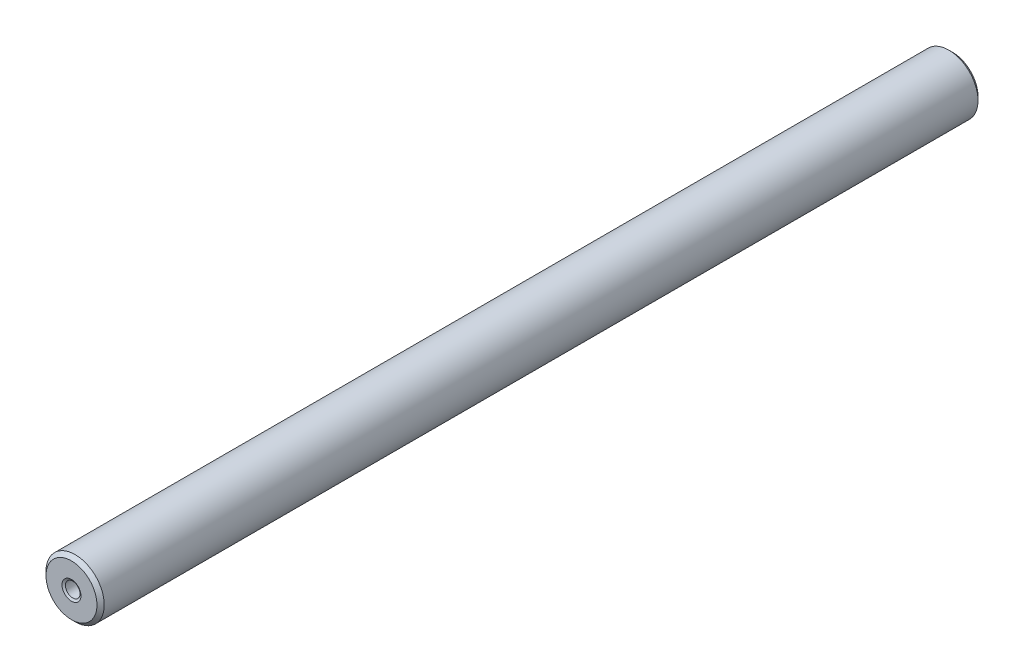
ISO-10303-21;
HEADER;
FILE_DESCRIPTION(('STEP AP214'),'2;1');
FILE_NAME('part.step','',(''),(''),'','','');
FILE_SCHEMA(('AUTOMOTIVE_DESIGN { 1 0 10303 214 1 1 1 1 }'));
ENDSEC;
DATA;
#1=APPLICATION_CONTEXT('core data for automotive mechanical design processes');
#2=APPLICATION_PROTOCOL_DEFINITION('international standard','automotive_design',2000,#1);
#3=PRODUCT_CONTEXT('',#1,'mechanical');
#4=PRODUCT('Part','Part','',(#3));
#5=PRODUCT_RELATED_PRODUCT_CATEGORY('part','',(#4));
#6=PRODUCT_DEFINITION_FORMATION('','',#4);
#7=PRODUCT_DEFINITION_CONTEXT('part definition',#1,'design');
#8=PRODUCT_DEFINITION('design','',#6,#7);
#9=PRODUCT_DEFINITION_SHAPE('','',#8);
#10=(LENGTH_UNIT() NAMED_UNIT(*) SI_UNIT(.MILLI.,.METRE.));
#11=(NAMED_UNIT(*) PLANE_ANGLE_UNIT() SI_UNIT($,.RADIAN.));
#12=(NAMED_UNIT(*) SI_UNIT($,.STERADIAN.) SOLID_ANGLE_UNIT());
#13=UNCERTAINTY_MEASURE_WITH_UNIT(LENGTH_MEASURE(1.E-05),#10,'distance_accuracy_value','');
#14=(GEOMETRIC_REPRESENTATION_CONTEXT(3) GLOBAL_UNCERTAINTY_ASSIGNED_CONTEXT((#13)) GLOBAL_UNIT_ASSIGNED_CONTEXT((#10,
#11,#12)) REPRESENTATION_CONTEXT('',''));
#15=CARTESIAN_POINT('',(0.,0.,0.));
#16=DIRECTION('',(0.,0.,1.));
#17=DIRECTION('',(1.,0.,0.));
#18=AXIS2_PLACEMENT_3D('',#15,#16,#17);
#19=CARTESIAN_POINT('',(0.,0.,119.));
#20=DIRECTION('',(0.,0.,1.));
#21=DIRECTION('',(1.,0.,0.));
#22=AXIS2_PLACEMENT_3D('',#19,#20,#21);
#23=CYLINDRICAL_SURFACE('',#22,1.);
#24=CARTESIAN_POINT('',(0.,0.,1.8267949192431));
#25=DIRECTION('',(0.,0.,1.));
#26=DIRECTION('',(1.,0.,0.));
#27=AXIS2_PLACEMENT_3D('',#24,#25,#26);
#28=CIRCLE('',#27,1.);
#29=CARTESIAN_POINT('',(1.,0.,1.8267949192431));
#30=VERTEX_POINT('',#29);
#31=EDGE_CURVE('E57',#30,#30,#28,.T.);
#32=ORIENTED_EDGE('',*,*,#31,.T.);
#33=EDGE_LOOP('',(#32));
#34=FACE_BOUND('',#33,.T.);
#35=CARTESIAN_POINT('',(0.,0.,0.299999999999981));
#36=DIRECTION('',(0.,0.,1.));
#37=DIRECTION('',(1.,0.,0.));
#38=AXIS2_PLACEMENT_3D('',#35,#36,#37);
#39=CIRCLE('',#38,1.);
#40=CARTESIAN_POINT('',(1.,0.,0.299999999999981));
#41=VERTEX_POINT('',#40);
#42=EDGE_CURVE('E60',#41,#41,#39,.F.);
#43=ORIENTED_EDGE('',*,*,#42,.T.);
#44=EDGE_LOOP('',(#43));
#45=FACE_BOUND('',#44,.T.);
#46=ADVANCED_FACE('F31',(#34,#45),#23,.F.);
#47=CARTESIAN_POINT('',(-1.,0.,0.));
#48=DIRECTION('',(0.,0.,1.));
#49=DIRECTION('',(1.,0.,0.));
#50=AXIS2_PLACEMENT_3D('',#47,#48,#49);
#51=PLANE('',#50);
#52=CARTESIAN_POINT('',(0.,0.,0.));
#53=DIRECTION('',(0.,0.,1.));
#54=DIRECTION('',(1.,0.,0.));
#55=AXIS2_PLACEMENT_3D('',#52,#53,#54);
#56=CIRCLE('',#55,1.17320508075687);
#57=CARTESIAN_POINT('',(1.17320508075687,0.,0.));
#58=VERTEX_POINT('',#57);
#59=EDGE_CURVE('E51',#58,#58,#56,.T.);
#60=ORIENTED_EDGE('',*,*,#59,.T.);
#61=EDGE_LOOP('',(#60));
#62=FACE_BOUND('',#61,.T.);
#63=CARTESIAN_POINT('',(0.,0.,0.));
#64=DIRECTION('',(0.,0.,1.));
#65=DIRECTION('',(1.,0.,0.));
#66=AXIS2_PLACEMENT_3D('',#63,#64,#65);
#67=CIRCLE('',#66,3.50000000000002);
#68=CARTESIAN_POINT('',(3.50000000000002,0.,0.));
#69=VERTEX_POINT('',#68);
#70=EDGE_CURVE('E66',#69,#69,#67,.F.);
#71=ORIENTED_EDGE('',*,*,#70,.T.);
#72=EDGE_LOOP('',(#71));
#73=FACE_BOUND('',#72,.T.);
#74=ADVANCED_FACE('F96',(#62,#73),#51,.F.);
#75=CARTESIAN_POINT('',(0.,0.,119.));
#76=DIRECTION('',(0.,0.,1.));
#77=DIRECTION('',(1.,0.,0.));
#78=AXIS2_PLACEMENT_3D('',#75,#76,#77);
#79=CYLINDRICAL_SURFACE('',#78,4.);
#80=CARTESIAN_POINT('',(0.,0.,0.499999999999973));
#81=DIRECTION('',(0.,0.,1.));
#82=DIRECTION('',(1.,0.,0.));
#83=AXIS2_PLACEMENT_3D('',#80,#81,#82);
#84=CIRCLE('',#83,4.);
#85=CARTESIAN_POINT('',(4.,0.,0.499999999999972));
#86=VERTEX_POINT('',#85);
#87=EDGE_CURVE('E69',#86,#86,#84,.T.);
#88=ORIENTED_EDGE('',*,*,#87,.T.);
#89=EDGE_LOOP('',(#88));
#90=FACE_BOUND('',#89,.T.);
#91=CARTESIAN_POINT('',(0.,0.,120.5));
#92=DIRECTION('',(0.,0.,-1.));
#93=DIRECTION('',(-1.,0.,0.));
#94=AXIS2_PLACEMENT_3D('',#91,#92,#93);
#95=CIRCLE('',#94,4.);
#96=CARTESIAN_POINT('',(-3.99999999999999,0.,120.5));
#97=VERTEX_POINT('',#96);
#98=EDGE_CURVE('E72',#97,#97,#95,.T.);
#99=ORIENTED_EDGE('',*,*,#98,.T.);
#100=EDGE_LOOP('',(#99));
#101=FACE_BOUND('',#100,.T.);
#102=ADVANCED_FACE('F76',(#90,#101),#79,.T.);
#103=CARTESIAN_POINT('',(-3.99999999999999,0.,121.));
#104=DIRECTION('',(0.,0.,-1.));
#105=DIRECTION('',(-1.,0.,0.));
#106=AXIS2_PLACEMENT_3D('',#103,#104,#105);
#107=PLANE('',#106);
#108=CARTESIAN_POINT('',(0.,0.,121.));
#109=DIRECTION('',(0.,0.,-1.));
#110=DIRECTION('',(-1.,0.,0.));
#111=AXIS2_PLACEMENT_3D('',#108,#109,#110);
#112=CIRCLE('',#111,1.30000000000004);
#113=CARTESIAN_POINT('',(-1.30000000000002,0.,121.));
#114=VERTEX_POINT('',#113);
#115=EDGE_CURVE('E10',#114,#114,#112,.T.);
#116=ORIENTED_EDGE('',*,*,#115,.T.);
#117=EDGE_LOOP('',(#116));
#118=FACE_BOUND('',#117,.T.);
#119=CARTESIAN_POINT('',(0.,0.,121.));
#120=DIRECTION('',(0.,0.,-1.));
#121=DIRECTION('',(-1.,0.,0.));
#122=AXIS2_PLACEMENT_3D('',#119,#120,#121);
#123=CIRCLE('',#122,3.50000000000003);
#124=CARTESIAN_POINT('',(-3.50000000000002,0.,121.));
#125=VERTEX_POINT('',#124);
#126=EDGE_CURVE('E63',#125,#125,#123,.F.);
#127=ORIENTED_EDGE('',*,*,#126,.T.);
#128=EDGE_LOOP('',(#127));
#129=FACE_BOUND('',#128,.T.);
#130=ADVANCED_FACE('F86',(#118,#129),#107,.F.);
#131=CARTESIAN_POINT('',(0.,0.,119.));
#132=DIRECTION('',(0.,0.,1.));
#133=DIRECTION('',(1.,0.,0.));
#134=AXIS2_PLACEMENT_3D('',#131,#132,#133);
#135=CYLINDRICAL_SURFACE('',#134,1.);
#136=CARTESIAN_POINT('',(0.,0.,119.3));
#137=DIRECTION('',(0.,0.,-1.));
#138=DIRECTION('',(-1.,0.,0.));
#139=AXIS2_PLACEMENT_3D('',#136,#137,#138);
#140=CIRCLE('',#139,1.);
#141=CARTESIAN_POINT('',(-0.999999999999985,0.,119.3));
#142=VERTEX_POINT('',#141);
#143=EDGE_CURVE('E38',#142,#142,#140,.T.);
#144=ORIENTED_EDGE('',*,*,#143,.T.);
#145=EDGE_LOOP('',(#144));
#146=FACE_BOUND('',#145,.T.);
#147=CARTESIAN_POINT('',(0.,0.,120.826794919243));
#148=DIRECTION('',(0.,0.,-1.));
#149=DIRECTION('',(-1.,0.,0.));
#150=AXIS2_PLACEMENT_3D('',#147,#148,#149);
#151=CIRCLE('',#150,1.);
#152=CARTESIAN_POINT('',(-0.999999999999985,0.,120.826794919243));
#153=VERTEX_POINT('',#152);
#154=EDGE_CURVE('E42',#153,#153,#151,.F.);
#155=ORIENTED_EDGE('',*,*,#154,.T.);
#156=EDGE_LOOP('',(#155));
#157=FACE_BOUND('',#156,.T.);
#158=ADVANCED_FACE('F88',(#146,#157),#135,.F.);
#159=CARTESIAN_POINT('',(0.,0.,119.));
#160=DIRECTION('',(0.,0.,-1.));
#161=DIRECTION('',(-1.,0.,0.));
#162=AXIS2_PLACEMENT_3D('',#159,#160,#161);
#163=PLANE('',#162);
#164=CARTESIAN_POINT('',(0.,0.,119.));
#165=DIRECTION('',(0.,0.,-1.));
#166=DIRECTION('',(-1.,0.,0.));
#167=AXIS2_PLACEMENT_3D('',#164,#165,#166);
#168=CIRCLE('',#167,0.826794919243167);
#169=CARTESIAN_POINT('',(-0.826794919243152,0.,119.));
#170=VERTEX_POINT('',#169);
#171=EDGE_CURVE('E46',#170,#170,#168,.F.);
#172=ORIENTED_EDGE('',*,*,#171,.T.);
#173=EDGE_LOOP('',(#172));
#174=FACE_BOUND('',#173,.T.);
#175=ADVANCED_FACE('F94',(#174),#163,.F.);
#176=CARTESIAN_POINT('',(0.,0.,2.));
#177=DIRECTION('',(0.,0.,1.));
#178=DIRECTION('',(1.,0.,0.));
#179=AXIS2_PLACEMENT_3D('',#176,#177,#178);
#180=PLANE('',#179);
#181=CARTESIAN_POINT('',(0.,0.,2.));
#182=DIRECTION('',(0.,0.,1.));
#183=DIRECTION('',(1.,0.,0.));
#184=AXIS2_PLACEMENT_3D('',#181,#182,#183);
#185=CIRCLE('',#184,0.700000000000009);
#186=CARTESIAN_POINT('',(0.700000000000009,0.,2.));
#187=VERTEX_POINT('',#186);
#188=EDGE_CURVE('E54',#187,#187,#185,.F.);
#189=ORIENTED_EDGE('',*,*,#188,.T.);
#190=EDGE_LOOP('',(#189));
#191=FACE_BOUND('',#190,.T.);
#192=ADVANCED_FACE('F110',(#191),#180,.F.);
#193=CARTESIAN_POINT('',(0.,0.,0.499999999999973));
#194=DIRECTION('',(0.,0.,1.));
#195=DIRECTION('',(1.,0.,0.));
#196=AXIS2_PLACEMENT_3D('',#193,#194,#195);
#197=CONICAL_SURFACE('',#196,4.,0.78539816339746);
#198=ORIENTED_EDGE('',*,*,#70,.F.);
#199=EDGE_LOOP('',(#198));
#200=FACE_BOUND('',#199,.T.);
#201=ORIENTED_EDGE('',*,*,#87,.F.);
#202=EDGE_LOOP('',(#201));
#203=FACE_BOUND('',#202,.T.);
#204=ADVANCED_FACE('F82',(#200,#203),#197,.T.);
#205=CARTESIAN_POINT('',(0.,0.,121.));
#206=DIRECTION('',(0.,0.,-1.));
#207=DIRECTION('',(-1.,0.,0.));
#208=AXIS2_PLACEMENT_3D('',#205,#206,#207);
#209=CONICAL_SURFACE('',#208,3.50000000000003,0.785398163397445);
#210=ORIENTED_EDGE('',*,*,#98,.F.);
#211=EDGE_LOOP('',(#210));
#212=FACE_BOUND('',#211,.T.);
#213=ORIENTED_EDGE('',*,*,#126,.F.);
#214=EDGE_LOOP('',(#213));
#215=FACE_BOUND('',#214,.T.);
#216=ADVANCED_FACE('F78',(#212,#215),#209,.T.);
#217=CARTESIAN_POINT('',(0.,0.,1.8267949192431));
#218=DIRECTION('',(0.,0.,-1.));
#219=DIRECTION('',(-1.,0.,0.));
#220=AXIS2_PLACEMENT_3D('',#217,#218,#219);
#221=CONICAL_SURFACE('',#220,1.,1.04719755119657);
#222=ORIENTED_EDGE('',*,*,#188,.F.);
#223=EDGE_LOOP('',(#222));
#224=FACE_BOUND('',#223,.T.);
#225=ORIENTED_EDGE('',*,*,#31,.F.);
#226=EDGE_LOOP('',(#225));
#227=FACE_BOUND('',#226,.T.);
#228=ADVANCED_FACE('F81',(#224,#227),#221,.F.);
#229=CARTESIAN_POINT('',(0.,0.,0.));
#230=DIRECTION('',(0.,0.,-1.));
#231=DIRECTION('',(-1.,0.,0.));
#232=AXIS2_PLACEMENT_3D('',#229,#230,#231);
#233=CONICAL_SURFACE('',#232,1.17320508075687,0.523598775598282);
#234=ORIENTED_EDGE('',*,*,#42,.F.);
#235=EDGE_LOOP('',(#234));
#236=FACE_BOUND('',#235,.T.);
#237=ORIENTED_EDGE('',*,*,#59,.F.);
#238=EDGE_LOOP('',(#237));
#239=FACE_BOUND('',#238,.T.);
#240=ADVANCED_FACE('F115',(#236,#239),#233,.F.);
#241=CARTESIAN_POINT('',(0.,0.,119.));
#242=DIRECTION('',(0.,0.,1.));
#243=DIRECTION('',(1.,0.,0.));
#244=AXIS2_PLACEMENT_3D('',#241,#242,#243);
#245=CONICAL_SURFACE('',#244,0.826794919243167,0.523598775598311);
#246=ORIENTED_EDGE('',*,*,#143,.F.);
#247=EDGE_LOOP('',(#246));
#248=FACE_BOUND('',#247,.T.);
#249=ORIENTED_EDGE('',*,*,#171,.F.);
#250=EDGE_LOOP('',(#249));
#251=FACE_BOUND('',#250,.T.);
#252=ADVANCED_FACE('F118',(#248,#251),#245,.F.);
#253=CARTESIAN_POINT('',(0.,0.,120.826794919243));
#254=DIRECTION('',(0.,0.,1.));
#255=DIRECTION('',(1.,0.,0.));
#256=AXIS2_PLACEMENT_3D('',#253,#254,#255);
#257=CONICAL_SURFACE('',#256,1.,1.04719755119659);
#258=ORIENTED_EDGE('',*,*,#115,.F.);
#259=EDGE_LOOP('',(#258));
#260=FACE_BOUND('',#259,.T.);
#261=ORIENTED_EDGE('',*,*,#154,.F.);
#262=EDGE_LOOP('',(#261));
#263=FACE_BOUND('',#262,.T.);
#264=ADVANCED_FACE('F33',(#260,#263),#257,.F.);
#265=CLOSED_SHELL('',(#46,#74,#102,#130,#158,#175,#192,#204,#216,#228,#240,#252,#264));
#266=MANIFOLD_SOLID_BREP('B2',#265);
#267=ADVANCED_BREP_SHAPE_REPRESENTATION('',(#18,#266),#14);
#268=SHAPE_DEFINITION_REPRESENTATION(#9,#267);
ENDSEC;
END-ISO-10303-21;
